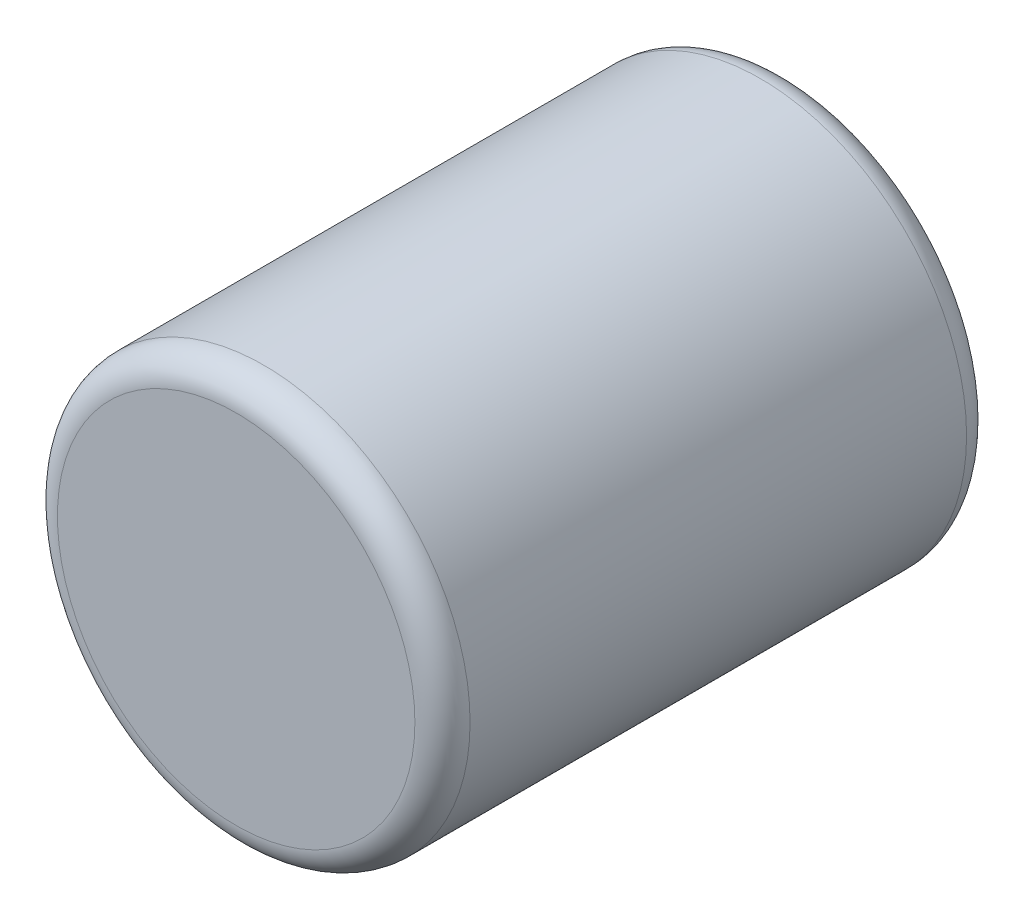
ISO-10303-21;
HEADER;
FILE_DESCRIPTION(('STEP AP214'),'2;1');
FILE_NAME('part.step','',(''),(''),'','','');
FILE_SCHEMA(('AUTOMOTIVE_DESIGN { 1 0 10303 214 1 1 1 1 }'));
ENDSEC;
DATA;
#1=APPLICATION_CONTEXT('core data for automotive mechanical design processes');
#2=APPLICATION_PROTOCOL_DEFINITION('international standard','automotive_design',2000,#1);
#3=PRODUCT_CONTEXT('',#1,'mechanical');
#4=PRODUCT('Part','Part','',(#3));
#5=PRODUCT_RELATED_PRODUCT_CATEGORY('part','',(#4));
#6=PRODUCT_DEFINITION_FORMATION('','',#4);
#7=PRODUCT_DEFINITION_CONTEXT('part definition',#1,'design');
#8=PRODUCT_DEFINITION('design','',#6,#7);
#9=PRODUCT_DEFINITION_SHAPE('','',#8);
#10=(LENGTH_UNIT() NAMED_UNIT(*) SI_UNIT(.MILLI.,.METRE.));
#11=(NAMED_UNIT(*) PLANE_ANGLE_UNIT() SI_UNIT($,.RADIAN.));
#12=(NAMED_UNIT(*) SI_UNIT($,.STERADIAN.) SOLID_ANGLE_UNIT());
#13=UNCERTAINTY_MEASURE_WITH_UNIT(LENGTH_MEASURE(1.E-05),#10,'distance_accuracy_value','');
#14=(GEOMETRIC_REPRESENTATION_CONTEXT(3) GLOBAL_UNCERTAINTY_ASSIGNED_CONTEXT((#13)) GLOBAL_UNIT_ASSIGNED_CONTEXT((#10,
#11,#12)) REPRESENTATION_CONTEXT('',''));
#15=CARTESIAN_POINT('',(0.,0.,0.));
#16=DIRECTION('',(0.,0.,1.));
#17=DIRECTION('',(1.,0.,0.));
#18=AXIS2_PLACEMENT_3D('',#15,#16,#17);
#19=CARTESIAN_POINT('',(0.,0.,-127.));
#20=DIRECTION('',(0.,0.,1.));
#21=DIRECTION('',(1.,0.,0.));
#22=AXIS2_PLACEMENT_3D('',#19,#20,#21);
#23=CYLINDRICAL_SURFACE('',#22,47.498);
#24=CARTESIAN_POINT('',(0.,0.,-120.65));
#25=DIRECTION('',(0.,0.,1.));
#26=DIRECTION('',(1.,0.,0.));
#27=AXIS2_PLACEMENT_3D('',#24,#25,#26);
#28=CIRCLE('',#27,47.498);
#29=CARTESIAN_POINT('',(47.498,0.,-120.65));
#30=VERTEX_POINT('',#29);
#31=EDGE_CURVE('E52',#30,#30,#28,.T.);
#32=ORIENTED_EDGE('',*,*,#31,.T.);
#33=EDGE_LOOP('',(#32));
#34=FACE_BOUND('',#33,.T.);
#35=CARTESIAN_POINT('',(0.,0.,-6.34999999999999));
#36=DIRECTION('',(0.,0.,1.));
#37=DIRECTION('',(1.,0.,0.));
#38=AXIS2_PLACEMENT_3D('',#35,#36,#37);
#39=CIRCLE('',#38,47.498);
#40=CARTESIAN_POINT('',(47.498,0.,-6.34999999999999));
#41=VERTEX_POINT('',#40);
#42=EDGE_CURVE('E56',#41,#41,#39,.F.);
#43=ORIENTED_EDGE('',*,*,#42,.T.);
#44=EDGE_LOOP('',(#43));
#45=FACE_BOUND('',#44,.T.);
#46=ADVANCED_FACE('F41',(#34,#45),#23,.T.);
#47=CARTESIAN_POINT('',(0.,0.,-127.));
#48=DIRECTION('',(0.,0.,1.));
#49=DIRECTION('',(1.,0.,0.));
#50=AXIS2_PLACEMENT_3D('',#47,#48,#49);
#51=PLANE('',#50);
#52=CARTESIAN_POINT('',(0.,0.,-127.));
#53=DIRECTION('',(0.,0.,1.));
#54=DIRECTION('',(1.,0.,0.));
#55=AXIS2_PLACEMENT_3D('',#52,#53,#54);
#56=CIRCLE('',#55,41.148);
#57=CARTESIAN_POINT('',(41.148,0.,-127.));
#58=VERTEX_POINT('',#57);
#59=EDGE_CURVE('E48',#58,#58,#56,.F.);
#60=ORIENTED_EDGE('',*,*,#59,.T.);
#61=EDGE_LOOP('',(#60));
#62=FACE_BOUND('',#61,.T.);
#63=ADVANCED_FACE('F72',(#62),#51,.F.);
#64=CARTESIAN_POINT('',(0.,0.,0.));
#65=DIRECTION('',(0.,0.,1.));
#66=DIRECTION('',(1.,0.,0.));
#67=AXIS2_PLACEMENT_3D('',#64,#65,#66);
#68=PLANE('',#67);
#69=CARTESIAN_POINT('',(0.,0.,0.));
#70=DIRECTION('',(0.,0.,1.));
#71=DIRECTION('',(1.,0.,0.));
#72=AXIS2_PLACEMENT_3D('',#69,#70,#71);
#73=CIRCLE('',#72,41.148);
#74=CARTESIAN_POINT('',(41.148,0.,0.));
#75=VERTEX_POINT('',#74);
#76=EDGE_CURVE('E10',#75,#75,#73,.T.);
#77=ORIENTED_EDGE('',*,*,#76,.T.);
#78=EDGE_LOOP('',(#77));
#79=FACE_BOUND('',#78,.T.);
#80=ADVANCED_FACE('F69',(#79),#68,.T.);
#81=CARTESIAN_POINT('',(0.,0.,-120.65));
#82=DIRECTION('',(0.,0.,1.));
#83=DIRECTION('',(1.,0.,0.));
#84=AXIS2_PLACEMENT_3D('',#81,#82,#83);
#85=TOROIDAL_SURFACE('',#84,41.148,6.35);
#86=ORIENTED_EDGE('',*,*,#59,.F.);
#87=EDGE_LOOP('',(#86));
#88=FACE_BOUND('',#87,.T.);
#89=ORIENTED_EDGE('',*,*,#31,.F.);
#90=EDGE_LOOP('',(#89));
#91=FACE_BOUND('',#90,.T.);
#92=ADVANCED_FACE('F65',(#88,#91),#85,.T.);
#93=CARTESIAN_POINT('',(0.,0.,-6.34999999999999));
#94=DIRECTION('',(0.,0.,1.));
#95=DIRECTION('',(1.,0.,0.));
#96=AXIS2_PLACEMENT_3D('',#93,#94,#95);
#97=TOROIDAL_SURFACE('',#96,41.148,6.35);
#98=ORIENTED_EDGE('',*,*,#42,.F.);
#99=EDGE_LOOP('',(#98));
#100=FACE_BOUND('',#99,.T.);
#101=ORIENTED_EDGE('',*,*,#76,.F.);
#102=EDGE_LOOP('',(#101));
#103=FACE_BOUND('',#102,.T.);
#104=ADVANCED_FACE('F43',(#100,#103),#97,.T.);
#105=CLOSED_SHELL('',(#46,#63,#80,#92,#104));
#106=MANIFOLD_SOLID_BREP('B2',#105);
#107=ADVANCED_BREP_SHAPE_REPRESENTATION('',(#18,#106),#14);
#108=SHAPE_DEFINITION_REPRESENTATION(#9,#107);
ENDSEC;
END-ISO-10303-21;
